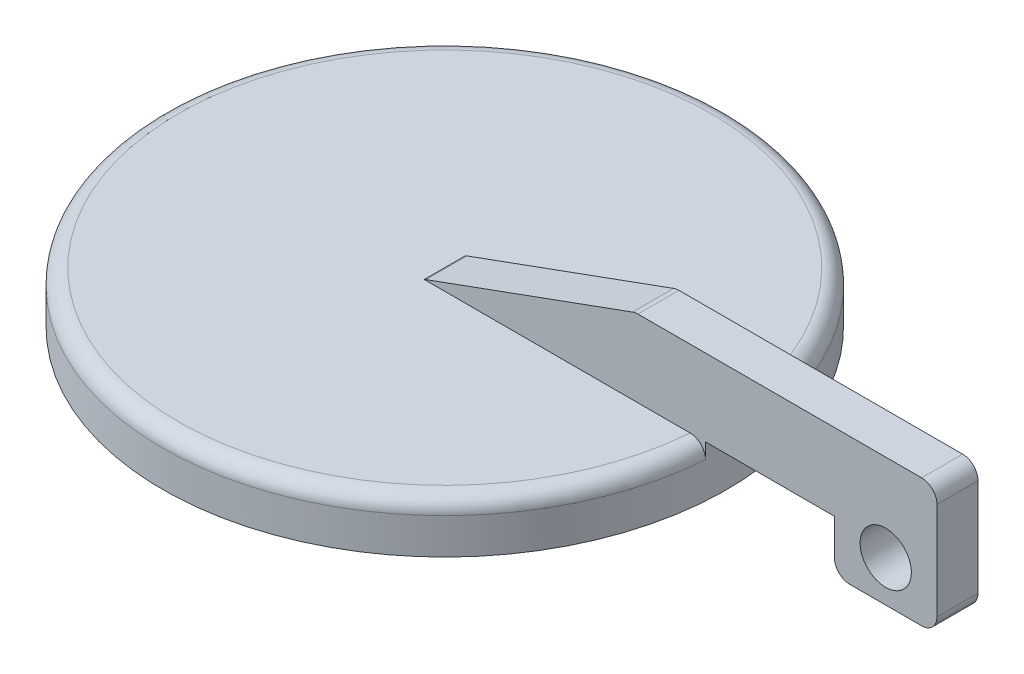
ISO-10303-21;
HEADER;
FILE_DESCRIPTION(('STEP AP214'),'2;1');
FILE_NAME('part.step','',(''),(''),'','','');
FILE_SCHEMA(('AUTOMOTIVE_DESIGN { 1 0 10303 214 1 1 1 1 }'));
ENDSEC;
DATA;
#1=APPLICATION_CONTEXT('core data for automotive mechanical design processes');
#2=APPLICATION_PROTOCOL_DEFINITION('international standard','automotive_design',2000,#1);
#3=PRODUCT_CONTEXT('',#1,'mechanical');
#4=PRODUCT('Part','Part','',(#3));
#5=PRODUCT_RELATED_PRODUCT_CATEGORY('part','',(#4));
#6=PRODUCT_DEFINITION_FORMATION('','',#4);
#7=PRODUCT_DEFINITION_CONTEXT('part definition',#1,'design');
#8=PRODUCT_DEFINITION('design','',#6,#7);
#9=PRODUCT_DEFINITION_SHAPE('','',#8);
#10=(LENGTH_UNIT() NAMED_UNIT(*) SI_UNIT(.MILLI.,.METRE.));
#11=(NAMED_UNIT(*) PLANE_ANGLE_UNIT() SI_UNIT($,.RADIAN.));
#12=(NAMED_UNIT(*) SI_UNIT($,.STERADIAN.) SOLID_ANGLE_UNIT());
#13=UNCERTAINTY_MEASURE_WITH_UNIT(LENGTH_MEASURE(1.E-05),#10,'distance_accuracy_value','');
#14=(GEOMETRIC_REPRESENTATION_CONTEXT(3) GLOBAL_UNCERTAINTY_ASSIGNED_CONTEXT((#13)) GLOBAL_UNIT_ASSIGNED_CONTEXT((#10,
#11,#12)) REPRESENTATION_CONTEXT('',''));
#15=CARTESIAN_POINT('',(0.,0.,0.));
#16=DIRECTION('',(0.,0.,1.));
#17=DIRECTION('',(1.,0.,0.));
#18=AXIS2_PLACEMENT_3D('',#15,#16,#17);
#19=CARTESIAN_POINT('',(0.,5.,0.));
#20=DIRECTION('',(0.,1.,0.));
#21=DIRECTION('',(0.,0.,1.));
#22=AXIS2_PLACEMENT_3D('',#19,#20,#21);
#23=PLANE('',#22);
#24=DIRECTION('',(0.,0.,-1.));
#25=VECTOR('',#24,1.);
#26=CARTESIAN_POINT('',(40.,5.,1.99999999999998));
#27=LINE('',#26,#25);
#28=CARTESIAN_POINT('',(40.,5.,1.99999999999998));
#29=VERTEX_POINT('',#28);
#30=CARTESIAN_POINT('',(40.,5.,-2.));
#31=VERTEX_POINT('',#30);
#32=EDGE_CURVE('E206',#29,#31,#27,.T.);
#33=ORIENTED_EDGE('',*,*,#32,.F.);
#34=DIRECTION('',(1.,0.,0.));
#35=VECTOR('',#34,1.);
#36=CARTESIAN_POINT('',(0.,5.,2.));
#37=LINE('',#36,#35);
#38=CARTESIAN_POINT('',(27.427176303805,5.,1.99999999999998));
#39=VERTEX_POINT('',#38);
#40=EDGE_CURVE('E171',#39,#29,#37,.T.);
#41=ORIENTED_EDGE('',*,*,#40,.F.);
#42=CARTESIAN_POINT('',(0.,5.,0.));
#43=DIRECTION('',(0.,-1.,0.));
#44=DIRECTION('',(0.,0.,-1.));
#45=AXIS2_PLACEMENT_3D('',#42,#43,#44);
#46=CIRCLE('',#45,27.5);
#47=CARTESIAN_POINT('',(27.427176303805,5.,-2.));
#48=VERTEX_POINT('',#47);
#49=EDGE_CURVE('E157',#48,#39,#46,.T.);
#50=ORIENTED_EDGE('',*,*,#49,.F.);
#51=DIRECTION('',(1.,0.,0.));
#52=VECTOR('',#51,1.);
#53=CARTESIAN_POINT('',(0.,5.,-2.));
#54=LINE('',#53,#52);
#55=EDGE_CURVE('E169',#48,#31,#54,.T.);
#56=ORIENTED_EDGE('',*,*,#55,.T.);
#57=EDGE_LOOP('',(#33,#41,#50,#56));
#58=FACE_BOUND('',#57,.T.);
#59=ADVANCED_FACE('F45',(#58),#23,.F.);
#60=CARTESIAN_POINT('',(0.,5.,0.));
#61=DIRECTION('',(0.,1.,0.));
#62=DIRECTION('',(0.,0.,1.));
#63=AXIS2_PLACEMENT_3D('',#60,#61,#62);
#64=PLANE('',#63);
#65=CARTESIAN_POINT('',(0.,5.,-2.));
#66=VERTEX_POINT('',#65);
#67=CARTESIAN_POINT('',(25.9229627936314,5.,-2.));
#68=VERTEX_POINT('',#67);
#69=EDGE_CURVE('E180',#66,#68,#54,.T.);
#70=ORIENTED_EDGE('',*,*,#69,.T.);
#71=CARTESIAN_POINT('',(0.,5.,0.));
#72=DIRECTION('',(0.,1.,0.));
#73=DIRECTION('',(0.,0.,1.));
#74=AXIS2_PLACEMENT_3D('',#71,#72,#73);
#75=CIRCLE('',#74,26.);
#76=CARTESIAN_POINT('',(25.9229627936314,5.,1.99999999999998));
#77=VERTEX_POINT('',#76);
#78=EDGE_CURVE('E164',#68,#77,#75,.T.);
#79=ORIENTED_EDGE('',*,*,#78,.T.);
#80=CARTESIAN_POINT('',(0.,5.,2.));
#81=VERTEX_POINT('',#80);
#82=EDGE_CURVE('E181',#81,#77,#37,.T.);
#83=ORIENTED_EDGE('',*,*,#82,.F.);
#84=DIRECTION('',(0.,0.,1.));
#85=VECTOR('',#84,1.);
#86=CARTESIAN_POINT('',(0.,5.,0.));
#87=LINE('',#86,#85);
#88=EDGE_CURVE('E315',#66,#81,#87,.T.);
#89=ORIENTED_EDGE('',*,*,#88,.F.);
#90=EDGE_LOOP('',(#70,#79,#83,#89));
#91=FACE_BOUND('',#90,.T.);
#92=ADVANCED_FACE('F303',(#91),#64,.T.);
#93=CARTESIAN_POINT('',(0.,0.,0.));
#94=DIRECTION('',(0.,-1.,0.));
#95=DIRECTION('',(0.,0.,-1.));
#96=AXIS2_PLACEMENT_3D('',#93,#94,#95);
#97=CYLINDRICAL_SURFACE('',#96,27.5);
#98=CARTESIAN_POINT('',(0.,3.5,0.));
#99=DIRECTION('',(0.,1.,0.));
#100=DIRECTION('',(0.,0.,1.));
#101=AXIS2_PLACEMENT_3D('',#98,#99,#100);
#102=CIRCLE('',#101,27.5);
#103=CARTESIAN_POINT('',(27.427176303805,3.5,1.99999999999998));
#104=VERTEX_POINT('',#103);
#105=CARTESIAN_POINT('',(27.427176303805,3.5,-2.));
#106=VERTEX_POINT('',#105);
#107=EDGE_CURVE('E160',#104,#106,#102,.F.);
#108=ORIENTED_EDGE('',*,*,#107,.T.);
#109=DIRECTION('',(0.,-1.,0.));
#110=VECTOR('',#109,1.);
#111=CARTESIAN_POINT('',(27.427176303805,3.5,-2.));
#112=LINE('',#111,#110);
#113=EDGE_CURVE('E153',#106,#48,#112,.F.);
#114=ORIENTED_EDGE('',*,*,#113,.T.);
#115=ORIENTED_EDGE('',*,*,#49,.T.);
#116=DIRECTION('',(0.,-1.,0.));
#117=VECTOR('',#116,1.);
#118=CARTESIAN_POINT('',(27.427176303805,5.,1.99999999999998));
#119=LINE('',#118,#117);
#120=EDGE_CURVE('E66',#39,#104,#119,.T.);
#121=ORIENTED_EDGE('',*,*,#120,.T.);
#122=EDGE_LOOP('',(#108,#114,#115,#121));
#123=FACE_BOUND('',#122,.T.);
#124=CARTESIAN_POINT('',(0.,0.,0.));
#125=DIRECTION('',(0.,-1.,0.));
#126=DIRECTION('',(0.,0.,-1.));
#127=AXIS2_PLACEMENT_3D('',#124,#125,#126);
#128=CIRCLE('',#127,27.5);
#129=CARTESIAN_POINT('',(0.,0.,-27.5));
#130=VERTEX_POINT('',#129);
#131=EDGE_CURVE('E173',#130,#130,#128,.T.);
#132=ORIENTED_EDGE('',*,*,#131,.F.);
#133=EDGE_LOOP('',(#132));
#134=FACE_BOUND('',#133,.T.);
#135=ADVANCED_FACE('F155',(#123,#134),#97,.T.);
#136=CARTESIAN_POINT('',(0.,0.,0.));
#137=DIRECTION('',(0.,-1.,0.));
#138=DIRECTION('',(0.,0.,-1.));
#139=AXIS2_PLACEMENT_3D('',#136,#137,#138);
#140=PLANE('',#139);
#141=ORIENTED_EDGE('',*,*,#131,.T.);
#142=EDGE_LOOP('',(#141));
#143=FACE_BOUND('',#142,.T.);
#144=ADVANCED_FACE('F297',(#143),#140,.T.);
#145=CARTESIAN_POINT('',(0.,12.5,2.));
#146=DIRECTION('',(0.,0.,-1.));
#147=DIRECTION('',(-1.,0.,0.));
#148=AXIS2_PLACEMENT_3D('',#145,#146,#147);
#149=PLANE('',#148);
#150=CARTESIAN_POINT('',(45.,4.,2.));
#151=DIRECTION('',(0.,0.,1.));
#152=DIRECTION('',(1.,0.,0.));
#153=AXIS2_PLACEMENT_3D('',#150,#151,#152);
#154=CIRCLE('',#153,2.5);
#155=CARTESIAN_POINT('',(47.5,4.,2.));
#156=VERTEX_POINT('',#155);
#157=EDGE_CURVE('E207',#156,#156,#154,.T.);
#158=ORIENTED_EDGE('',*,*,#157,.F.);
#159=EDGE_LOOP('',(#158));
#160=FACE_BOUND('',#159,.T.);
#161=DIRECTION('',(0.,1.,0.));
#162=VECTOR('',#161,1.);
#163=CARTESIAN_POINT('',(40.,0.,1.99999999999998));
#164=LINE('',#163,#162);
#165=CARTESIAN_POINT('',(40.,1.5,1.99999999999998));
#166=VERTEX_POINT('',#165);
#167=EDGE_CURVE('E339',#166,#29,#164,.T.);
#168=ORIENTED_EDGE('',*,*,#167,.F.);
#169=CARTESIAN_POINT('',(41.5,1.5,1.99999999999997));
#170=DIRECTION('',(0.,0.,-1.));
#171=DIRECTION('',(-1.,0.,0.));
#172=AXIS2_PLACEMENT_3D('',#169,#170,#171);
#173=CIRCLE('',#172,1.5);
#174=CARTESIAN_POINT('',(41.5,0.,1.99999999999997));
#175=VERTEX_POINT('',#174);
#176=EDGE_CURVE('E251',#166,#175,#173,.F.);
#177=ORIENTED_EDGE('',*,*,#176,.T.);
#178=DIRECTION('',(-1.,0.,0.));
#179=VECTOR('',#178,1.);
#180=CARTESIAN_POINT('',(50.,0.,1.99999999999997));
#181=LINE('',#180,#179);
#182=CARTESIAN_POINT('',(48.5,0.,1.99999999999997));
#183=VERTEX_POINT('',#182);
#184=EDGE_CURVE('E347',#183,#175,#181,.T.);
#185=ORIENTED_EDGE('',*,*,#184,.F.);
#186=CARTESIAN_POINT('',(48.5,1.5,1.99999999999997));
#187=DIRECTION('',(0.,0.,-1.));
#188=DIRECTION('',(-1.,0.,0.));
#189=AXIS2_PLACEMENT_3D('',#186,#187,#188);
#190=CIRCLE('',#189,1.5);
#191=CARTESIAN_POINT('',(50.,1.5,1.99999999999997));
#192=VERTEX_POINT('',#191);
#193=EDGE_CURVE('E73',#183,#192,#190,.F.);
#194=ORIENTED_EDGE('',*,*,#193,.T.);
#195=DIRECTION('',(0.,-1.,0.));
#196=VECTOR('',#195,1.);
#197=CARTESIAN_POINT('',(50.,12.5,1.99999999999997));
#198=LINE('',#197,#196);
#199=CARTESIAN_POINT('',(50.,11.,1.99999999999997));
#200=VERTEX_POINT('',#199);
#201=EDGE_CURVE('E195',#200,#192,#198,.T.);
#202=ORIENTED_EDGE('',*,*,#201,.F.);
#203=CARTESIAN_POINT('',(48.5,11.,1.99999999999997));
#204=DIRECTION('',(0.,0.,-1.));
#205=DIRECTION('',(-1.,0.,0.));
#206=AXIS2_PLACEMENT_3D('',#203,#204,#205);
#207=CIRCLE('',#206,1.5);
#208=CARTESIAN_POINT('',(48.5,12.5,1.99999999999997));
#209=VERTEX_POINT('',#208);
#210=EDGE_CURVE('E246',#200,#209,#207,.F.);
#211=ORIENTED_EDGE('',*,*,#210,.T.);
#212=DIRECTION('',(1.,0.,0.));
#213=VECTOR('',#212,1.);
#214=CARTESIAN_POINT('',(0.,12.5,2.));
#215=LINE('',#214,#213);
#216=CARTESIAN_POINT('',(20.8341592688748,12.5,1.99999999999999));
#217=VERTEX_POINT('',#216);
#218=EDGE_CURVE('E186',#217,#209,#215,.T.);
#219=ORIENTED_EDGE('',*,*,#218,.F.);
#220=CARTESIAN_POINT('',(20.8341592688748,11.,1.99999999999999));
#221=DIRECTION('',(0.,0.,-1.));
#222=DIRECTION('',(-1.,0.,0.));
#223=AXIS2_PLACEMENT_3D('',#220,#221,#222);
#224=CIRCLE('',#223,1.5);
#225=CARTESIAN_POINT('',(20.3211290538863,12.4095389311789,1.99999999999999));
#226=VERTEX_POINT('',#225);
#227=EDGE_CURVE('E243',#217,#226,#224,.F.);
#228=ORIENTED_EDGE('',*,*,#227,.T.);
#229=DIRECTION('',(-0.939692620785908,-0.342020143325669,0.));
#230=VECTOR('',#229,1.);
#231=CARTESIAN_POINT('',(2.40619415922517,5.88903588070527,2.));
#232=LINE('',#231,#230);
#233=CARTESIAN_POINT('',(0.176995771016584,5.07767402112315,2.));
#234=VERTEX_POINT('',#233);
#235=EDGE_CURVE('E324',#226,#234,#232,.T.);
#236=ORIENTED_EDGE('',*,*,#235,.T.);
#237=CARTESIAN_POINT('',(0.690025986005089,3.66813508994429,2.));
#238=DIRECTION('',(0.,0.,-1.));
#239=DIRECTION('',(-1.,0.,0.));
#240=AXIS2_PLACEMENT_3D('',#237,#238,#239);
#241=CIRCLE('',#240,1.5);
#242=EDGE_CURVE('E240',#234,#81,#241,.F.);
#243=ORIENTED_EDGE('',*,*,#242,.T.);
#244=ORIENTED_EDGE('',*,*,#82,.T.);
#245=CARTESIAN_POINT('',(25.9229627936314,5.,1.99999999999998));
#246=CARTESIAN_POINT('',(25.9653729480787,4.99999965216564,1.99999999999998));
#247=CARTESIAN_POINT('',(26.0077628398878,4.99821090373499,1.99999999999998));
#248=CARTESIAN_POINT('',(26.092240129067,4.9910740970971,1.99999999999998));
#249=CARTESIAN_POINT('',(26.1343275386775,4.985726183745,1.99999999999998));
#250=CARTESIAN_POINT('',(26.2596177589086,4.96439194251417,1.99999999999998));
#251=CARTESIAN_POINT('',(26.3419826163859,4.94311498632637,1.99999999999998));
#252=CARTESIAN_POINT('',(26.5019706786206,4.88703057158685,1.99999999999998));
#253=CARTESIAN_POINT('',(26.5795914149557,4.85221613752277,1.99999999999998));
#254=CARTESIAN_POINT('',(26.7278708681592,4.77003585492724,1.99999999999998));
#255=CARTESIAN_POINT('',(26.7985309938963,4.72267255355116,1.99999999999998));
#256=CARTESIAN_POINT('',(26.930770976215,4.61680402250241,1.99999999999998));
#257=CARTESIAN_POINT('',(26.9923638138409,4.55831500146362,1.99999999999998));
#258=CARTESIAN_POINT('',(27.1048371557191,4.43178743843332,1.99999999999998));
#259=CARTESIAN_POINT('',(27.1557156117521,4.36374707469104,1.99999999999998));
#260=CARTESIAN_POINT('',(27.2451617446548,4.22024895777597,1.99999999999998));
#261=CARTESIAN_POINT('',(27.2837595984428,4.14480999190816,1.99999999999998));
#262=CARTESIAN_POINT('',(27.3476873121796,3.98852800664074,1.99999999999998));
#263=CARTESIAN_POINT('',(27.3730254524489,3.90768839544975,1.99999999999998));
#264=CARTESIAN_POINT('',(27.4032722075482,3.77194325919539,1.99999999999998));
#265=CARTESIAN_POINT('',(27.412230877445,3.71790582393354,1.99999999999998));
#266=CARTESIAN_POINT('',(27.4241820032785,3.60925330065371,1.99999999999998));
#267=CARTESIAN_POINT('',(27.4271829411269,3.55463914530497,1.99999999999998));
#268=CARTESIAN_POINT('',(27.427176303805,3.5,1.99999999999998));
#269=B_SPLINE_CURVE_WITH_KNOTS('',3,(#245,#246,#247,#248,#249,#250,#251,#252,#253,#254,#255,
#256,#257,#258,#259,#260,#261,#262,#263,#264,#265,#266,#267,#268),.UNSPECIFIED.,.F.,.F.,(4,2,2,
2,2,2,2,2,2,2,2,4),(0.,0.127152471203018,0.254299767719707,0.508197305361338,0.762225843574172,
1.016202858802,1.269812659905,1.52347089851004,1.77650092484765,2.02937275188253,
2.19339283831518,2.3571792444821),.UNSPECIFIED.);
#270=EDGE_CURVE('E11',#77,#104,#269,.T.);
#271=ORIENTED_EDGE('',*,*,#270,.T.);
#272=ORIENTED_EDGE('',*,*,#120,.F.);
#273=ORIENTED_EDGE('',*,*,#40,.T.);
#274=EDGE_LOOP('',(#168,#177,#185,#194,#202,#211,#219,#228,#236,#243,#244,#271,#272,#273));
#275=FACE_BOUND('',#274,.T.);
#276=ADVANCED_FACE('F292',(#160,#275),#149,.F.);
#277=CARTESIAN_POINT('',(50.,12.5,0.));
#278=DIRECTION('',(-1.,0.,0.));
#279=DIRECTION('',(0.,0.,1.));
#280=AXIS2_PLACEMENT_3D('',#277,#278,#279);
#281=PLANE('',#280);
#282=ORIENTED_EDGE('',*,*,#201,.T.);
#283=DIRECTION('',(0.,0.,1.));
#284=VECTOR('',#283,1.);
#285=CARTESIAN_POINT('',(50.,1.5,-2.));
#286=LINE('',#285,#284);
#287=CARTESIAN_POINT('',(50.,1.5,-2.));
#288=VERTEX_POINT('',#287);
#289=EDGE_CURVE('E257',#192,#288,#286,.F.);
#290=ORIENTED_EDGE('',*,*,#289,.T.);
#291=DIRECTION('',(0.,-1.,0.));
#292=VECTOR('',#291,1.);
#293=CARTESIAN_POINT('',(50.,12.5,-2.));
#294=LINE('',#293,#292);
#295=CARTESIAN_POINT('',(50.,11.,-2.));
#296=VERTEX_POINT('',#295);
#297=EDGE_CURVE('E191',#296,#288,#294,.T.);
#298=ORIENTED_EDGE('',*,*,#297,.F.);
#299=DIRECTION('',(0.,0.,-1.));
#300=VECTOR('',#299,1.);
#301=CARTESIAN_POINT('',(50.,11.,1.99999999999997));
#302=LINE('',#301,#300);
#303=EDGE_CURVE('E254',#296,#200,#302,.F.);
#304=ORIENTED_EDGE('',*,*,#303,.T.);
#305=EDGE_LOOP('',(#282,#290,#298,#304));
#306=FACE_BOUND('',#305,.T.);
#307=ADVANCED_FACE('F288',(#306),#281,.F.);
#308=CARTESIAN_POINT('',(0.,12.5,-2.));
#309=DIRECTION('',(0.,0.,-1.));
#310=DIRECTION('',(-1.,0.,0.));
#311=AXIS2_PLACEMENT_3D('',#308,#309,#310);
#312=PLANE('',#311);
#313=CARTESIAN_POINT('',(45.,4.,-2.));
#314=DIRECTION('',(0.,0.,-1.));
#315=DIRECTION('',(-1.,0.,0.));
#316=AXIS2_PLACEMENT_3D('',#313,#314,#315);
#317=CIRCLE('',#316,2.5);
#318=CARTESIAN_POINT('',(42.5,4.,-2.));
#319=VERTEX_POINT('',#318);
#320=EDGE_CURVE('E202',#319,#319,#317,.T.);
#321=ORIENTED_EDGE('',*,*,#320,.F.);
#322=EDGE_LOOP('',(#321));
#323=FACE_BOUND('',#322,.T.);
#324=DIRECTION('',(1.,0.,0.));
#325=VECTOR('',#324,1.);
#326=CARTESIAN_POINT('',(40.,0.,-2.));
#327=LINE('',#326,#325);
#328=CARTESIAN_POINT('',(41.5,0.,-2.));
#329=VERTEX_POINT('',#328);
#330=CARTESIAN_POINT('',(48.5,0.,-2.));
#331=VERTEX_POINT('',#330);
#332=EDGE_CURVE('E344',#329,#331,#327,.T.);
#333=ORIENTED_EDGE('',*,*,#332,.F.);
#334=CARTESIAN_POINT('',(41.5,1.5,-2.));
#335=DIRECTION('',(0.,0.,-1.));
#336=DIRECTION('',(-1.,0.,0.));
#337=AXIS2_PLACEMENT_3D('',#334,#335,#336);
#338=CIRCLE('',#337,1.5);
#339=CARTESIAN_POINT('',(40.,1.5,-2.));
#340=VERTEX_POINT('',#339);
#341=EDGE_CURVE('E234',#329,#340,#338,.T.);
#342=ORIENTED_EDGE('',*,*,#341,.T.);
#343=DIRECTION('',(0.,1.,0.));
#344=VECTOR('',#343,1.);
#345=CARTESIAN_POINT('',(40.,0.,-2.));
#346=LINE('',#345,#344);
#347=EDGE_CURVE('E178',#340,#31,#346,.T.);
#348=ORIENTED_EDGE('',*,*,#347,.T.);
#349=ORIENTED_EDGE('',*,*,#55,.F.);
#350=ORIENTED_EDGE('',*,*,#113,.F.);
#351=CARTESIAN_POINT('',(27.427176303805,3.5,-2.));
#352=CARTESIAN_POINT('',(27.4271760793853,3.54211957292395,-2.));
#353=CARTESIAN_POINT('',(27.4253964141217,3.58421894055812,-2.));
#354=CARTESIAN_POINT('',(27.4182969858845,3.66811582305537,-2.));
#355=CARTESIAN_POINT('',(27.4129774105158,3.70991335379626,-2.));
#356=CARTESIAN_POINT('',(27.3917610803046,3.83432486322586,-2.));
#357=CARTESIAN_POINT('',(27.3706065710669,3.9161045216594,-2.));
#358=CARTESIAN_POINT('',(27.3148722008168,4.07494769702515,-2.));
#359=CARTESIAN_POINT('',(27.2802862258115,4.15200904766712,-2.));
#360=CARTESIAN_POINT('',(27.1986850654499,4.29923934489097,-2.));
#361=CARTESIAN_POINT('',(27.1516718179513,4.36940936374088,-2.));
#362=CARTESIAN_POINT('',(27.0465003236122,4.50095509198716,-2.));
#363=CARTESIAN_POINT('',(26.9883296269338,4.56232084231875,-2.));
#364=CARTESIAN_POINT('',(26.8625212486933,4.67445795542915,-2.));
#365=CARTESIAN_POINT('',(26.7948816813793,4.72522720285571,-2.));
#366=CARTESIAN_POINT('',(26.6518786968185,4.81485944606138,-2.));
#367=CARTESIAN_POINT('',(26.5764948101097,4.85368974578527,-2.));
#368=CARTESIAN_POINT('',(26.4203033253821,4.91816171045774,-2.));
#369=CARTESIAN_POINT('',(26.3394986998903,4.94381053786171,-2.));
#370=CARTESIAN_POINT('',(26.2023468418152,4.9749749482792,-2.));
#371=CARTESIAN_POINT('',(26.1468462481838,4.98435387290548,-2.));
#372=CARTESIAN_POINT('',(26.0352255758221,4.99686568047718,-2.));
#373=CARTESIAN_POINT('',(25.9791064909201,5.00000743187764,-2.));
#374=CARTESIAN_POINT('',(25.9229627936314,5.,-2.));
#375=B_SPLINE_CURVE_WITH_KNOTS('',3,(#351,#352,#353,#354,#355,#356,#357,#358,#359,#360,#361,
#362,#363,#364,#365,#366,#367,#368,#369,#370,#371,#372,#373,#374),.UNSPECIFIED.,.F.,.F.,(4,2,2,
2,2,2,2,2,2,2,2,4),(0.,0.126281013560543,0.252555335130543,0.504669301221202,0.756898164170182,
1.00908771877028,1.26156032903703,1.51408329164924,1.76729177845238,2.02036253275587,
2.18889764843945,2.35719295682644),.UNSPECIFIED.);
#376=EDGE_CURVE('E60',#106,#68,#375,.T.);
#377=ORIENTED_EDGE('',*,*,#376,.T.);
#378=ORIENTED_EDGE('',*,*,#69,.F.);
#379=CARTESIAN_POINT('',(0.690025986005087,3.66813508994429,-2.));
#380=DIRECTION('',(0.,0.,-1.));
#381=DIRECTION('',(-1.,0.,0.));
#382=AXIS2_PLACEMENT_3D('',#379,#380,#381);
#383=CIRCLE('',#382,1.5);
#384=CARTESIAN_POINT('',(0.176995771016583,5.07767402112315,-2.));
#385=VERTEX_POINT('',#384);
#386=EDGE_CURVE('E222',#66,#385,#383,.T.);
#387=ORIENTED_EDGE('',*,*,#386,.T.);
#388=DIRECTION('',(-0.939692620785908,-0.342020143325669,0.));
#389=VECTOR('',#388,1.);
#390=CARTESIAN_POINT('',(2.40619415922517,5.88903588070527,-2.));
#391=LINE('',#390,#389);
#392=CARTESIAN_POINT('',(20.3211290538863,12.4095389311789,-2.));
#393=VERTEX_POINT('',#392);
#394=EDGE_CURVE('E327',#393,#385,#391,.T.);
#395=ORIENTED_EDGE('',*,*,#394,.F.);
#396=CARTESIAN_POINT('',(20.8341592688748,11.,-2.));
#397=DIRECTION('',(0.,0.,-1.));
#398=DIRECTION('',(-1.,0.,0.));
#399=AXIS2_PLACEMENT_3D('',#396,#397,#398);
#400=CIRCLE('',#399,1.5);
#401=CARTESIAN_POINT('',(20.8341592688748,12.5,-2.));
#402=VERTEX_POINT('',#401);
#403=EDGE_CURVE('E225',#393,#402,#400,.T.);
#404=ORIENTED_EDGE('',*,*,#403,.T.);
#405=DIRECTION('',(1.,0.,0.));
#406=VECTOR('',#405,1.);
#407=CARTESIAN_POINT('',(0.,12.5,-2.));
#408=LINE('',#407,#406);
#409=CARTESIAN_POINT('',(48.5,12.5,-2.));
#410=VERTEX_POINT('',#409);
#411=EDGE_CURVE('E196',#402,#410,#408,.T.);
#412=ORIENTED_EDGE('',*,*,#411,.T.);
#413=CARTESIAN_POINT('',(48.5,11.,-2.));
#414=DIRECTION('',(0.,0.,-1.));
#415=DIRECTION('',(-1.,0.,0.));
#416=AXIS2_PLACEMENT_3D('',#413,#414,#415);
#417=CIRCLE('',#416,1.5);
#418=EDGE_CURVE('E228',#410,#296,#417,.T.);
#419=ORIENTED_EDGE('',*,*,#418,.T.);
#420=ORIENTED_EDGE('',*,*,#297,.T.);
#421=CARTESIAN_POINT('',(48.5,1.5,-2.));
#422=DIRECTION('',(0.,0.,-1.));
#423=DIRECTION('',(-1.,0.,0.));
#424=AXIS2_PLACEMENT_3D('',#421,#422,#423);
#425=CIRCLE('',#424,1.5);
#426=EDGE_CURVE('E231',#288,#331,#425,.T.);
#427=ORIENTED_EDGE('',*,*,#426,.T.);
#428=EDGE_LOOP('',(#333,#342,#348,#349,#350,#377,#378,#387,#395,#404,#412,#419,#420,#427));
#429=FACE_BOUND('',#428,.T.);
#430=ADVANCED_FACE('F176',(#323,#429),#312,.T.);
#431=CARTESIAN_POINT('',(0.,12.5,0.));
#432=DIRECTION('',(0.,1.,0.));
#433=DIRECTION('',(0.,0.,1.));
#434=AXIS2_PLACEMENT_3D('',#431,#432,#433);
#435=PLANE('',#434);
#436=ORIENTED_EDGE('',*,*,#218,.T.);
#437=DIRECTION('',(0.,0.,-1.));
#438=VECTOR('',#437,1.);
#439=CARTESIAN_POINT('',(48.5,12.5,-2.));
#440=LINE('',#439,#438);
#441=EDGE_CURVE('E263',#209,#410,#440,.T.);
#442=ORIENTED_EDGE('',*,*,#441,.T.);
#443=ORIENTED_EDGE('',*,*,#411,.F.);
#444=DIRECTION('',(0.,0.,-1.));
#445=VECTOR('',#444,1.);
#446=CARTESIAN_POINT('',(20.8341592688748,12.5,1.99999999999999));
#447=LINE('',#446,#445);
#448=EDGE_CURVE('E260',#402,#217,#447,.F.);
#449=ORIENTED_EDGE('',*,*,#448,.T.);
#450=EDGE_LOOP('',(#436,#442,#443,#449));
#451=FACE_BOUND('',#450,.T.);
#452=ADVANCED_FACE('F287',(#451),#435,.T.);
#453=CARTESIAN_POINT('',(-1.61122840131571,4.42681365019888,-15.));
#454=DIRECTION('',(0.342020143325669,-0.939692620785908,0.));
#455=DIRECTION('',(0.939692620785908,0.342020143325669,0.));
#456=AXIS2_PLACEMENT_3D('',#453,#454,#455);
#457=PLANE('',#456);
#458=ORIENTED_EDGE('',*,*,#235,.F.);
#459=DIRECTION('',(0.,0.,-1.));
#460=VECTOR('',#459,1.);
#461=CARTESIAN_POINT('',(20.3211290538863,12.4095389311789,-2.));
#462=LINE('',#461,#460);
#463=EDGE_CURVE('E270',#226,#393,#462,.T.);
#464=ORIENTED_EDGE('',*,*,#463,.T.);
#465=ORIENTED_EDGE('',*,*,#394,.T.);
#466=DIRECTION('',(0.,0.,1.));
#467=VECTOR('',#466,1.);
#468=CARTESIAN_POINT('',(0.17699577101658,5.07767402112315,-15.));
#469=LINE('',#468,#467);
#470=EDGE_CURVE('E267',#385,#234,#469,.T.);
#471=ORIENTED_EDGE('',*,*,#470,.T.);
#472=EDGE_LOOP('',(#458,#464,#465,#471));
#473=FACE_BOUND('',#472,.T.);
#474=ADVANCED_FACE('F373',(#473),#457,.F.);
#475=CARTESIAN_POINT('',(40.,0.,1.99999999999998));
#476=DIRECTION('',(1.,0.,0.));
#477=DIRECTION('',(0.,0.,-1.));
#478=AXIS2_PLACEMENT_3D('',#475,#476,#477);
#479=PLANE('',#478);
#480=ORIENTED_EDGE('',*,*,#347,.F.);
#481=DIRECTION('',(0.,0.,-1.));
#482=VECTOR('',#481,1.);
#483=CARTESIAN_POINT('',(40.,1.5,1.99999999999998));
#484=LINE('',#483,#482);
#485=EDGE_CURVE('E237',#340,#166,#484,.F.);
#486=ORIENTED_EDGE('',*,*,#485,.T.);
#487=ORIENTED_EDGE('',*,*,#167,.T.);
#488=ORIENTED_EDGE('',*,*,#32,.T.);
#489=EDGE_LOOP('',(#480,#486,#487,#488));
#490=FACE_BOUND('',#489,.T.);
#491=ADVANCED_FACE('F367',(#490),#479,.F.);
#492=CARTESIAN_POINT('',(0.,0.,0.));
#493=DIRECTION('',(0.,-1.,0.));
#494=DIRECTION('',(0.,0.,-1.));
#495=AXIS2_PLACEMENT_3D('',#492,#493,#494);
#496=PLANE('',#495);
#497=ORIENTED_EDGE('',*,*,#184,.T.);
#498=DIRECTION('',(0.,0.,-1.));
#499=VECTOR('',#498,1.);
#500=CARTESIAN_POINT('',(41.5,0.,-2.));
#501=LINE('',#500,#499);
#502=EDGE_CURVE('E218',#175,#329,#501,.T.);
#503=ORIENTED_EDGE('',*,*,#502,.T.);
#504=ORIENTED_EDGE('',*,*,#332,.T.);
#505=DIRECTION('',(0.,0.,1.));
#506=VECTOR('',#505,1.);
#507=CARTESIAN_POINT('',(48.5,0.,1.99999999999997));
#508=LINE('',#507,#506);
#509=EDGE_CURVE('E214',#331,#183,#508,.T.);
#510=ORIENTED_EDGE('',*,*,#509,.T.);
#511=EDGE_LOOP('',(#497,#503,#504,#510));
#512=FACE_BOUND('',#511,.T.);
#513=ADVANCED_FACE('F359',(#512),#496,.T.);
#514=CARTESIAN_POINT('',(45.,4.,-8.));
#515=DIRECTION('',(0.,0.,1.));
#516=DIRECTION('',(1.,0.,0.));
#517=AXIS2_PLACEMENT_3D('',#514,#515,#516);
#518=CYLINDRICAL_SURFACE('',#517,2.5);
#519=ORIENTED_EDGE('',*,*,#320,.T.);
#520=EDGE_LOOP('',(#519));
#521=FACE_BOUND('',#520,.T.);
#522=ORIENTED_EDGE('',*,*,#157,.T.);
#523=EDGE_LOOP('',(#522));
#524=FACE_BOUND('',#523,.T.);
#525=ADVANCED_FACE('F358',(#521,#524),#518,.F.);
#526=CARTESIAN_POINT('',(0.,3.5,0.));
#527=DIRECTION('',(0.,1.,0.));
#528=DIRECTION('',(0.,0.,1.));
#529=AXIS2_PLACEMENT_3D('',#526,#527,#528);
#530=TOROIDAL_SURFACE('',#529,26.,1.5);
#531=ORIENTED_EDGE('',*,*,#270,.F.);
#532=ORIENTED_EDGE('',*,*,#78,.F.);
#533=ORIENTED_EDGE('',*,*,#376,.F.);
#534=ORIENTED_EDGE('',*,*,#107,.F.);
#535=EDGE_LOOP('',(#531,#532,#533,#534));
#536=FACE_BOUND('',#535,.T.);
#537=ADVANCED_FACE('F279',(#536),#530,.T.);
#538=CARTESIAN_POINT('',(41.5,1.5,0.));
#539=DIRECTION('',(0.,0.,1.));
#540=DIRECTION('',(1.,0.,0.));
#541=AXIS2_PLACEMENT_3D('',#538,#539,#540);
#542=CYLINDRICAL_SURFACE('',#541,1.5);
#543=ORIENTED_EDGE('',*,*,#176,.F.);
#544=ORIENTED_EDGE('',*,*,#485,.F.);
#545=ORIENTED_EDGE('',*,*,#341,.F.);
#546=ORIENTED_EDGE('',*,*,#502,.F.);
#547=EDGE_LOOP('',(#543,#544,#545,#546));
#548=FACE_BOUND('',#547,.T.);
#549=ADVANCED_FACE('F365',(#548),#542,.T.);
#550=CARTESIAN_POINT('',(48.5,1.5,0.));
#551=DIRECTION('',(0.,0.,-1.));
#552=DIRECTION('',(-1.,0.,0.));
#553=AXIS2_PLACEMENT_3D('',#550,#551,#552);
#554=CYLINDRICAL_SURFACE('',#553,1.5);
#555=ORIENTED_EDGE('',*,*,#426,.F.);
#556=ORIENTED_EDGE('',*,*,#289,.F.);
#557=ORIENTED_EDGE('',*,*,#193,.F.);
#558=ORIENTED_EDGE('',*,*,#509,.F.);
#559=EDGE_LOOP('',(#555,#556,#557,#558));
#560=FACE_BOUND('',#559,.T.);
#561=ADVANCED_FACE('F394',(#560),#554,.T.);
#562=CARTESIAN_POINT('',(48.5,11.,0.));
#563=DIRECTION('',(0.,0.,1.));
#564=DIRECTION('',(1.,0.,0.));
#565=AXIS2_PLACEMENT_3D('',#562,#563,#564);
#566=CYLINDRICAL_SURFACE('',#565,1.5);
#567=ORIENTED_EDGE('',*,*,#210,.F.);
#568=ORIENTED_EDGE('',*,*,#303,.F.);
#569=ORIENTED_EDGE('',*,*,#418,.F.);
#570=ORIENTED_EDGE('',*,*,#441,.F.);
#571=EDGE_LOOP('',(#567,#568,#569,#570));
#572=FACE_BOUND('',#571,.T.);
#573=ADVANCED_FACE('F388',(#572),#566,.T.);
#574=CARTESIAN_POINT('',(20.8341592688748,11.,-15.));
#575=DIRECTION('',(0.,0.,1.));
#576=DIRECTION('',(1.,0.,0.));
#577=AXIS2_PLACEMENT_3D('',#574,#575,#576);
#578=CYLINDRICAL_SURFACE('',#577,1.5);
#579=ORIENTED_EDGE('',*,*,#227,.F.);
#580=ORIENTED_EDGE('',*,*,#448,.F.);
#581=ORIENTED_EDGE('',*,*,#403,.F.);
#582=ORIENTED_EDGE('',*,*,#463,.F.);
#583=EDGE_LOOP('',(#579,#580,#581,#582));
#584=FACE_BOUND('',#583,.T.);
#585=ADVANCED_FACE('F407',(#584),#578,.T.);
#586=CARTESIAN_POINT('',(0.690025986005088,3.66813508994429,0.));
#587=DIRECTION('',(0.,0.,1.));
#588=DIRECTION('',(1.,0.,0.));
#589=AXIS2_PLACEMENT_3D('',#586,#587,#588);
#590=CYLINDRICAL_SURFACE('',#589,1.5);
#591=ORIENTED_EDGE('',*,*,#242,.F.);
#592=ORIENTED_EDGE('',*,*,#470,.F.);
#593=ORIENTED_EDGE('',*,*,#386,.F.);
#594=ORIENTED_EDGE('',*,*,#88,.T.);
#595=EDGE_LOOP('',(#591,#592,#593,#594));
#596=FACE_BOUND('',#595,.T.);
#597=ADVANCED_FACE('F47',(#596),#590,.T.);
#598=CLOSED_SHELL('',(#59,#92,#135,#144,#276,#307,#430,#452,#474,#491,#513,#525,#537,#549,#561,
#573,#585,#597));
#599=MANIFOLD_SOLID_BREP('B2',#598);
#600=ADVANCED_BREP_SHAPE_REPRESENTATION('',(#18,#599),#14);
#601=SHAPE_DEFINITION_REPRESENTATION(#9,#600);
ENDSEC;
END-ISO-10303-21;
